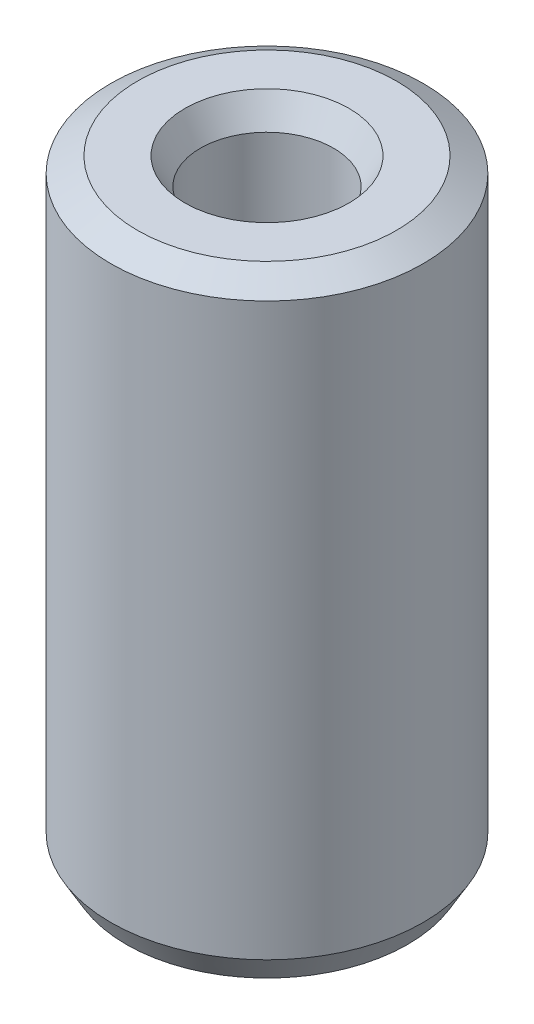
ISO-10303-21;
HEADER;
FILE_DESCRIPTION(('STEP AP214'),'2;1');
FILE_NAME('part.step','',(''),(''),'','','');
FILE_SCHEMA(('AUTOMOTIVE_DESIGN { 1 0 10303 214 1 1 1 1 }'));
ENDSEC;
DATA;
#1=APPLICATION_CONTEXT('core data for automotive mechanical design processes');
#2=APPLICATION_PROTOCOL_DEFINITION('international standard','automotive_design',2000,#1);
#3=PRODUCT_CONTEXT('',#1,'mechanical');
#4=PRODUCT('Part','Part','',(#3));
#5=PRODUCT_RELATED_PRODUCT_CATEGORY('part','',(#4));
#6=PRODUCT_DEFINITION_FORMATION('','',#4);
#7=PRODUCT_DEFINITION_CONTEXT('part definition',#1,'design');
#8=PRODUCT_DEFINITION('design','',#6,#7);
#9=PRODUCT_DEFINITION_SHAPE('','',#8);
#10=(LENGTH_UNIT() NAMED_UNIT(*) SI_UNIT(.MILLI.,.METRE.));
#11=(NAMED_UNIT(*) PLANE_ANGLE_UNIT() SI_UNIT($,.RADIAN.));
#12=(NAMED_UNIT(*) SI_UNIT($,.STERADIAN.) SOLID_ANGLE_UNIT());
#13=UNCERTAINTY_MEASURE_WITH_UNIT(LENGTH_MEASURE(1.E-05),#10,'distance_accuracy_value','');
#14=(GEOMETRIC_REPRESENTATION_CONTEXT(3) GLOBAL_UNCERTAINTY_ASSIGNED_CONTEXT((#13)) GLOBAL_UNIT_ASSIGNED_CONTEXT((#10,
#11,#12)) REPRESENTATION_CONTEXT('',''));
#15=CARTESIAN_POINT('',(0.,0.,0.));
#16=DIRECTION('',(0.,0.,1.));
#17=DIRECTION('',(1.,0.,0.));
#18=AXIS2_PLACEMENT_3D('',#15,#16,#17);
#19=CARTESIAN_POINT('',(0.,39.2273246499054,0.));
#20=DIRECTION('',(0.,-1.,0.));
#21=DIRECTION('',(0.,0.,-1.));
#22=AXIS2_PLACEMENT_3D('',#19,#20,#21);
#23=CYLINDRICAL_SURFACE('',#22,10.);
#24=CARTESIAN_POINT('',(0.,1.71229747937977,0.));
#25=DIRECTION('',(0.,1.,0.));
#26=DIRECTION('',(0.,0.,1.));
#27=AXIS2_PLACEMENT_3D('',#24,#25,#26);
#28=CIRCLE('',#27,10.);
#29=CARTESIAN_POINT('',(0.,1.71229747937977,10.));
#30=VERTEX_POINT('',#29);
#31=EDGE_CURVE('E10',#30,#30,#28,.T.);
#32=ORIENTED_EDGE('',*,*,#31,.T.);
#33=EDGE_LOOP('',(#32));
#34=FACE_BOUND('',#33,.T.);
#35=CARTESIAN_POINT('',(0.,38.2387292392528,0.));
#36=DIRECTION('',(0.,1.,0.));
#37=DIRECTION('',(0.,0.,1.));
#38=AXIS2_PLACEMENT_3D('',#35,#36,#37);
#39=CIRCLE('',#38,10.);
#40=CARTESIAN_POINT('',(0.,38.2387292392528,10.));
#41=VERTEX_POINT('',#40);
#42=EDGE_CURVE('E50',#41,#41,#39,.F.);
#43=ORIENTED_EDGE('',*,*,#42,.T.);
#44=EDGE_LOOP('',(#43));
#45=FACE_BOUND('',#44,.T.);
#46=ADVANCED_FACE('F39',(#34,#45),#23,.T.);
#47=CARTESIAN_POINT('',(0.,39.2273246499054,0.));
#48=DIRECTION('',(0.,1.,0.));
#49=DIRECTION('',(0.,0.,1.));
#50=AXIS2_PLACEMENT_3D('',#47,#48,#49);
#51=PLANE('',#50);
#52=CARTESIAN_POINT('',(0.,39.2273246499054,0.));
#53=DIRECTION('',(0.,1.,0.));
#54=DIRECTION('',(0.,0.,1.));
#55=AXIS2_PLACEMENT_3D('',#52,#53,#54);
#56=CIRCLE('',#55,5.25230353062747);
#57=CARTESIAN_POINT('',(0.,39.2273246499054,5.25230353062747));
#58=VERTEX_POINT('',#57);
#59=EDGE_CURVE('E58',#58,#58,#56,.F.);
#60=ORIENTED_EDGE('',*,*,#59,.T.);
#61=EDGE_LOOP('',(#60));
#62=FACE_BOUND('',#61,.T.);
#63=CARTESIAN_POINT('',(0.,39.2273246499054,0.));
#64=DIRECTION('',(0.,1.,0.));
#65=DIRECTION('',(0.,0.,1.));
#66=AXIS2_PLACEMENT_3D('',#63,#64,#65);
#67=CIRCLE('',#66,8.28770252062023);
#68=CARTESIAN_POINT('',(0.,39.2273246499054,8.28770252062023));
#69=VERTEX_POINT('',#68);
#70=EDGE_CURVE('E61',#69,#69,#67,.T.);
#71=ORIENTED_EDGE('',*,*,#70,.T.);
#72=EDGE_LOOP('',(#71));
#73=FACE_BOUND('',#72,.T.);
#74=ADVANCED_FACE('F88',(#62,#73),#51,.T.);
#75=CARTESIAN_POINT('',(0.,0.,0.));
#76=DIRECTION('',(0.,1.,0.));
#77=DIRECTION('',(0.,0.,1.));
#78=AXIS2_PLACEMENT_3D('',#75,#76,#77);
#79=PLANE('',#78);
#80=CARTESIAN_POINT('',(0.,0.,0.));
#81=DIRECTION('',(0.,1.,0.));
#82=DIRECTION('',(0.,0.,1.));
#83=AXIS2_PLACEMENT_3D('',#80,#81,#82);
#84=CIRCLE('',#83,5.9760055993546);
#85=CARTESIAN_POINT('',(0.,0.,5.9760055993546));
#86=VERTEX_POINT('',#85);
#87=EDGE_CURVE('E51',#86,#86,#84,.T.);
#88=ORIENTED_EDGE('',*,*,#87,.T.);
#89=EDGE_LOOP('',(#88));
#90=FACE_BOUND('',#89,.T.);
#91=CARTESIAN_POINT('',(0.,0.,0.));
#92=DIRECTION('',(0.,1.,0.));
#93=DIRECTION('',(0.,0.,1.));
#94=AXIS2_PLACEMENT_3D('',#91,#92,#93);
#95=CIRCLE('',#94,9.01140458934736);
#96=CARTESIAN_POINT('',(0.,0.,9.01140458934736));
#97=VERTEX_POINT('',#96);
#98=EDGE_CURVE('E54',#97,#97,#95,.F.);
#99=ORIENTED_EDGE('',*,*,#98,.T.);
#100=EDGE_LOOP('',(#99));
#101=FACE_BOUND('',#100,.T.);
#102=ADVANCED_FACE('F83',(#90,#101),#79,.F.);
#103=CARTESIAN_POINT('',(0.,39.2273246499054,0.));
#104=DIRECTION('',(0.,-1.,0.));
#105=DIRECTION('',(0.,0.,-1.));
#106=AXIS2_PLACEMENT_3D('',#103,#104,#105);
#107=CYLINDRICAL_SURFACE('',#106,4.26370811997484);
#108=CARTESIAN_POINT('',(0.,37.5150271705256,0.));
#109=DIRECTION('',(0.,1.,0.));
#110=DIRECTION('',(0.,0.,1.));
#111=AXIS2_PLACEMENT_3D('',#108,#109,#110);
#112=CIRCLE('',#111,4.26370811997484);
#113=CARTESIAN_POINT('',(0.,37.5150271705256,4.26370811997484));
#114=VERTEX_POINT('',#113);
#115=EDGE_CURVE('E67',#114,#114,#112,.T.);
#116=ORIENTED_EDGE('',*,*,#115,.T.);
#117=EDGE_LOOP('',(#116));
#118=FACE_BOUND('',#117,.T.);
#119=CARTESIAN_POINT('',(0.,0.988595410652632,0.));
#120=DIRECTION('',(0.,1.,0.));
#121=DIRECTION('',(0.,0.,1.));
#122=AXIS2_PLACEMENT_3D('',#119,#120,#121);
#123=CIRCLE('',#122,4.26370811997484);
#124=CARTESIAN_POINT('',(0.,0.988595410652632,4.26370811997484));
#125=VERTEX_POINT('',#124);
#126=EDGE_CURVE('E69',#125,#125,#123,.F.);
#127=ORIENTED_EDGE('',*,*,#126,.T.);
#128=EDGE_LOOP('',(#127));
#129=FACE_BOUND('',#128,.T.);
#130=ADVANCED_FACE('F71',(#118,#129),#107,.F.);
#131=CARTESIAN_POINT('',(0.,37.5150271705256,0.));
#132=DIRECTION('',(0.,1.,0.));
#133=DIRECTION('',(0.,0.,1.));
#134=AXIS2_PLACEMENT_3D('',#131,#132,#133);
#135=CONICAL_SURFACE('',#134,4.26370811997484,0.523598775598298);
#136=ORIENTED_EDGE('',*,*,#59,.F.);
#137=EDGE_LOOP('',(#136));
#138=FACE_BOUND('',#137,.T.);
#139=ORIENTED_EDGE('',*,*,#115,.F.);
#140=EDGE_LOOP('',(#139));
#141=FACE_BOUND('',#140,.T.);
#142=ADVANCED_FACE('F77',(#138,#141),#135,.F.);
#143=CARTESIAN_POINT('',(0.,0.,0.));
#144=DIRECTION('',(0.,-1.,0.));
#145=DIRECTION('',(0.,0.,-1.));
#146=AXIS2_PLACEMENT_3D('',#143,#144,#145);
#147=CONICAL_SURFACE('',#146,5.9760055993546,1.04719755119659);
#148=ORIENTED_EDGE('',*,*,#126,.F.);
#149=EDGE_LOOP('',(#148));
#150=FACE_BOUND('',#149,.T.);
#151=ORIENTED_EDGE('',*,*,#87,.F.);
#152=EDGE_LOOP('',(#151));
#153=FACE_BOUND('',#152,.T.);
#154=ADVANCED_FACE('F73',(#150,#153),#147,.F.);
#155=CARTESIAN_POINT('',(0.,1.71229747937977,0.));
#156=DIRECTION('',(0.,1.,0.));
#157=DIRECTION('',(0.,0.,1.));
#158=AXIS2_PLACEMENT_3D('',#155,#156,#157);
#159=CONICAL_SURFACE('',#158,10.,0.523598775598303);
#160=CARTESIAN_POINT('',(0.,0.,9.01140458934736));
#161=CARTESIAN_POINT('',(0.,0.0178364320768726,9.02170245820832));
#162=CARTESIAN_POINT('',(0.,0.0356728641537452,9.03200032706929));
#163=CARTESIAN_POINT('',(0.,0.0713457283074904,9.05259606479122));
#164=CARTESIAN_POINT('',(0.,0.0891821603843631,9.06289393365219));
#165=CARTESIAN_POINT('',(0.,0.124855024538108,9.08348967137412));
#166=CARTESIAN_POINT('',(0.,0.142691456614981,9.09378754023508));
#167=CARTESIAN_POINT('',(0.,0.178364320768726,9.11438327795701));
#168=CARTESIAN_POINT('',(0.,0.196200752845599,9.12468114681798));
#169=CARTESIAN_POINT('',(0.,0.231873616999344,9.14527688453991));
#170=CARTESIAN_POINT('',(0.,0.249710049076217,9.15557475340087));
#171=CARTESIAN_POINT('',(0.,0.285382913229962,9.1761704911228));
#172=CARTESIAN_POINT('',(0.,0.303219345306835,9.18646835998377));
#173=CARTESIAN_POINT('',(0.,0.33889220946058,9.2070640977057));
#174=CARTESIAN_POINT('',(0.,0.356728641537453,9.21736196656666));
#175=CARTESIAN_POINT('',(0.,0.392401505691198,9.23795770428859));
#176=CARTESIAN_POINT('',(0.,0.410237937768071,9.24825557314956));
#177=CARTESIAN_POINT('',(0.,0.445910801921816,9.26885131087149));
#178=CARTESIAN_POINT('',(0.,0.463747233998688,9.27914917973245));
#179=CARTESIAN_POINT('',(0.,0.499420098152434,9.29974491745438));
#180=CARTESIAN_POINT('',(0.,0.517256530229306,9.31004278631535));
#181=CARTESIAN_POINT('',(0.,0.552929394383052,9.33063852403728));
#182=CARTESIAN_POINT('',(0.,0.570765826459924,9.34093639289824));
#183=CARTESIAN_POINT('',(0.,0.60643869061367,9.36153213062017));
#184=CARTESIAN_POINT('',(0.,0.624275122690542,9.37182999948114));
#185=CARTESIAN_POINT('',(0.,0.659947986844288,9.39242573720307));
#186=CARTESIAN_POINT('',(0.,0.67778441892116,9.40272360606403));
#187=CARTESIAN_POINT('',(0.,0.713457283074906,9.42331934378596));
#188=CARTESIAN_POINT('',(0.,0.731293715151778,9.43361721264693));
#189=CARTESIAN_POINT('',(0.,0.766966579305523,9.45421295036886));
#190=CARTESIAN_POINT('',(0.,0.784803011382396,9.46451081922982));
#191=CARTESIAN_POINT('',(0.,0.820475875536141,9.48510655695175));
#192=CARTESIAN_POINT('',(0.,0.838312307613014,9.49540442581272));
#193=CARTESIAN_POINT('',(0.,0.873985171766759,9.51600016353465));
#194=CARTESIAN_POINT('',(0.,0.891821603843632,9.52629803239561));
#195=CARTESIAN_POINT('',(0.,0.927494467997377,9.54689377011754));
#196=CARTESIAN_POINT('',(0.,0.94533090007425,9.55719163897851));
#197=CARTESIAN_POINT('',(0.,0.981003764227995,9.57778737670044));
#198=CARTESIAN_POINT('',(0.,0.998840196304868,9.5880852455614));
#199=CARTESIAN_POINT('',(0.,1.03451306045861,9.60868098328333));
#200=CARTESIAN_POINT('',(0.,1.05234949253549,9.6189788521443));
#201=CARTESIAN_POINT('',(0.,1.08802235668923,9.63957458986623));
#202=CARTESIAN_POINT('',(0.,1.1058587887661,9.64987245872719));
#203=CARTESIAN_POINT('',(0.,1.14153165291985,9.67046819644912));
#204=CARTESIAN_POINT('',(0.,1.15936808499672,9.68076606531009));
#205=CARTESIAN_POINT('',(0.,1.19504094915047,9.70136180303202));
#206=CARTESIAN_POINT('',(0.,1.21287738122734,9.71165967189298));
#207=CARTESIAN_POINT('',(0.,1.24855024538108,9.73225540961491));
#208=CARTESIAN_POINT('',(0.,1.26638667745796,9.74255327847588));
#209=CARTESIAN_POINT('',(0.,1.3020595416117,9.76314901619781));
#210=CARTESIAN_POINT('',(0.,1.31989597368858,9.77344688505877));
#211=CARTESIAN_POINT('',(0.,1.35556883784232,9.7940426227807));
#212=CARTESIAN_POINT('',(0.,1.37340526991919,9.80434049164167));
#213=CARTESIAN_POINT('',(0.,1.40907813407294,9.8249362293636));
#214=CARTESIAN_POINT('',(0.,1.42691456614981,9.83523409822456));
#215=CARTESIAN_POINT('',(0.,1.46258743030356,9.85582983594649));
#216=CARTESIAN_POINT('',(0.,1.48042386238043,9.86612770480746));
#217=CARTESIAN_POINT('',(0.,1.51609672653417,9.88672344252939));
#218=CARTESIAN_POINT('',(0.,1.53393315861105,9.89702131139035));
#219=CARTESIAN_POINT('',(0.,1.56960602276479,9.91761704911228));
#220=CARTESIAN_POINT('',(0.,1.58744245484166,9.92791491797325));
#221=CARTESIAN_POINT('',(0.,1.62311531899541,9.94851065569518));
#222=CARTESIAN_POINT('',(0.,1.64095175107228,9.95880852455614));
#223=CARTESIAN_POINT('',(0.,1.67662461522603,9.97940426227807));
#224=CARTESIAN_POINT('',(0.,1.6944610473029,9.98970213113904));
#225=CARTESIAN_POINT('',(0.,1.71229747937977,10.));
#226=B_SPLINE_CURVE_WITH_KNOTS('',3,(#160,#161,#162,#163,#164,#165,#166,#167,#168,#169,#170,
#171,#172,#173,#174,#175,#176,#177,#178,#179,#180,#181,#182,#183,#184,#185,#186,#187,#188,#189,
#190,#191,#192,#193,#194,#195,#196,#197,#198,#199,#200,#201,#202,#203,#204,#205,#206,#207,#208,
#209,#210,#211,#212,#213,#214,#215,#216,#217,#218,#219,#220,#221,#222,#223,#224,#225),
.UNSPECIFIED.,.F.,.F.,(4,2,2,2,2,2,2,2,2,2,2,2,2,2,2,2,2,2,2,2,2,2,2,2,2,2,2,2,2,2,2,2,4),(0.,
0.061787213165789,0.123574426331579,0.185361639497369,0.247148852663158,0.308936065828947,
0.370723278994737,0.432510492160526,0.494297705326316,0.556084918492106,0.617872131657895,
0.679659344823685,0.741446557989475,0.803233771155264,0.865020984321053,0.926808197486843,
0.988595410652632,1.05038262381842,1.11216983698421,1.17395705015,1.23574426331579,
1.29753147648158,1.35931868964737,1.42110590281316,1.48289311597895,1.54468032914474,
1.60646754231053,1.66825475547632,1.73004196864211,1.7918291818079,1.85361639497369,
1.91540360813948,1.97719082130527),.UNSPECIFIED.);
#227=EDGE_CURVE('BSEAM76',#97,#30,#226,.T.);
#228=ORIENTED_EDGE('',*,*,#98,.F.);
#229=ORIENTED_EDGE('',*,*,#31,.F.);
#230=ORIENTED_EDGE('',*,*,#227,.T.);
#231=ORIENTED_EDGE('',*,*,#227,.F.);
#232=EDGE_LOOP('',(#228,#230,#229,#231));
#233=FACE_BOUND('',#232,.T.);
#234=ADVANCED_FACE('F76',(#233),#159,.T.);
#235=CARTESIAN_POINT('',(0.,39.2273246499054,0.));
#236=DIRECTION('',(0.,-1.,0.));
#237=DIRECTION('',(0.,0.,-1.));
#238=AXIS2_PLACEMENT_3D('',#235,#236,#237);
#239=CONICAL_SURFACE('',#238,8.28770252062023,1.0471975511966);
#240=ORIENTED_EDGE('',*,*,#42,.F.);
#241=EDGE_LOOP('',(#240));
#242=FACE_BOUND('',#241,.T.);
#243=ORIENTED_EDGE('',*,*,#70,.F.);
#244=EDGE_LOOP('',(#243));
#245=FACE_BOUND('',#244,.T.);
#246=ADVANCED_FACE('F45',(#242,#245),#239,.T.);
#247=CLOSED_SHELL('',(#46,#74,#102,#130,#142,#154,#234,#246));
#248=MANIFOLD_SOLID_BREP('B2',#247);
#249=ADVANCED_BREP_SHAPE_REPRESENTATION('',(#18,#248),#14);
#250=SHAPE_DEFINITION_REPRESENTATION(#9,#249);
ENDSEC;
END-ISO-10303-21;
